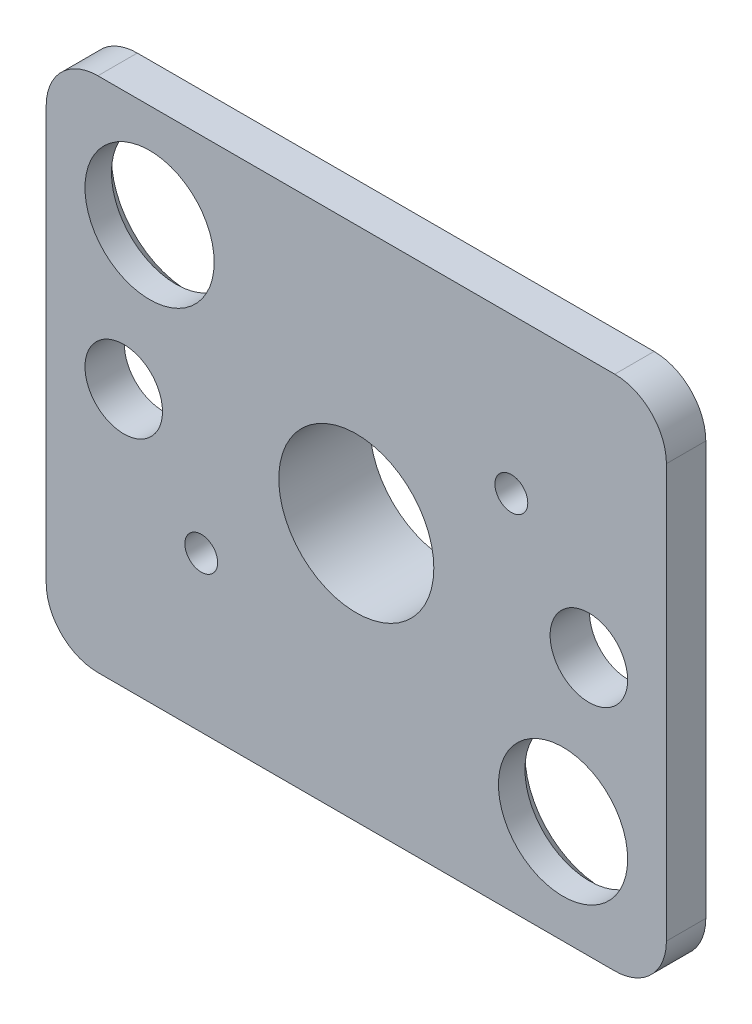
ISO-10303-21;
HEADER;
FILE_DESCRIPTION(('STEP AP214'),'2;1');
FILE_NAME('part.step','',(''),(''),'','','');
FILE_SCHEMA(('AUTOMOTIVE_DESIGN { 1 0 10303 214 1 1 1 1 }'));
ENDSEC;
DATA;
#1=APPLICATION_CONTEXT('core data for automotive mechanical design processes');
#2=APPLICATION_PROTOCOL_DEFINITION('international standard','automotive_design',2000,#1);
#3=PRODUCT_CONTEXT('',#1,'mechanical');
#4=PRODUCT('Part','Part','',(#3));
#5=PRODUCT_RELATED_PRODUCT_CATEGORY('part','',(#4));
#6=PRODUCT_DEFINITION_FORMATION('','',#4);
#7=PRODUCT_DEFINITION_CONTEXT('part definition',#1,'design');
#8=PRODUCT_DEFINITION('design','',#6,#7);
#9=PRODUCT_DEFINITION_SHAPE('','',#8);
#10=(LENGTH_UNIT() NAMED_UNIT(*) SI_UNIT(.MILLI.,.METRE.));
#11=(NAMED_UNIT(*) PLANE_ANGLE_UNIT() SI_UNIT($,.RADIAN.));
#12=(NAMED_UNIT(*) SI_UNIT($,.STERADIAN.) SOLID_ANGLE_UNIT());
#13=UNCERTAINTY_MEASURE_WITH_UNIT(LENGTH_MEASURE(1.E-05),#10,'distance_accuracy_value','');
#14=(GEOMETRIC_REPRESENTATION_CONTEXT(3) GLOBAL_UNCERTAINTY_ASSIGNED_CONTEXT((#13)) GLOBAL_UNIT_ASSIGNED_CONTEXT((#10,
#11,#12)) REPRESENTATION_CONTEXT('',''));
#15=CARTESIAN_POINT('',(0.,0.,0.));
#16=DIRECTION('',(0.,0.,1.));
#17=DIRECTION('',(1.,0.,0.));
#18=AXIS2_PLACEMENT_3D('',#15,#16,#17);
#19=CARTESIAN_POINT('',(6.,-5.,-1.));
#20=DIRECTION('',(0.,0.,1.));
#21=DIRECTION('',(1.,0.,0.));
#22=AXIS2_PLACEMENT_3D('',#19,#20,#21);
#23=CYLINDRICAL_SURFACE('',#22,1.5);
#24=CARTESIAN_POINT('',(6.,-5.,0.762));
#25=DIRECTION('',(0.,0.,1.));
#26=DIRECTION('',(1.,0.,0.));
#27=AXIS2_PLACEMENT_3D('',#24,#25,#26);
#28=CIRCLE('',#27,1.5);
#29=CARTESIAN_POINT('',(7.5,-5.,0.762));
#30=VERTEX_POINT('',#29);
#31=EDGE_CURVE('E91',#30,#30,#28,.F.);
#32=ORIENTED_EDGE('',*,*,#31,.F.);
#33=EDGE_LOOP('',(#32));
#34=FACE_BOUND('',#33,.T.);
#35=CARTESIAN_POINT('',(6.,-5.,-1.));
#36=DIRECTION('',(0.,0.,1.));
#37=DIRECTION('',(1.,0.,0.));
#38=AXIS2_PLACEMENT_3D('',#35,#36,#37);
#39=CIRCLE('',#38,1.5);
#40=CARTESIAN_POINT('',(7.5,-5.,-1.));
#41=VERTEX_POINT('',#40);
#42=EDGE_CURVE('E21',#41,#41,#39,.T.);
#43=ORIENTED_EDGE('',*,*,#42,.F.);
#44=EDGE_LOOP('',(#43));
#45=FACE_BOUND('',#44,.T.);
#46=ADVANCED_FACE('F17',(#34,#45),#23,.F.);
#47=CARTESIAN_POINT('',(2.,-2.,0.25));
#48=DIRECTION('',(0.,0.,1.));
#49=DIRECTION('',(1.,0.,0.));
#50=AXIS2_PLACEMENT_3D('',#47,#48,#49);
#51=CYLINDRICAL_SURFACE('',#50,1.25);
#52=CARTESIAN_POINT('',(2.,-2.,0.762));
#53=DIRECTION('',(0.,0.,1.));
#54=DIRECTION('',(1.,0.,0.));
#55=AXIS2_PLACEMENT_3D('',#52,#53,#54);
#56=CIRCLE('',#55,1.25);
#57=CARTESIAN_POINT('',(3.25,-2.,0.762));
#58=VERTEX_POINT('',#57);
#59=EDGE_CURVE('E174',#58,#58,#56,.F.);
#60=ORIENTED_EDGE('',*,*,#59,.F.);
#61=EDGE_LOOP('',(#60));
#62=FACE_BOUND('',#61,.T.);
#63=CARTESIAN_POINT('',(2.,-2.,0.249999999999972));
#64=DIRECTION('',(0.,0.,-1.));
#65=DIRECTION('',(-1.,0.,0.));
#66=AXIS2_PLACEMENT_3D('',#63,#64,#65);
#67=CIRCLE('',#66,1.25);
#68=CARTESIAN_POINT('',(0.75,-2.,0.25));
#69=VERTEX_POINT('',#68);
#70=EDGE_CURVE('E100',#69,#69,#67,.F.);
#71=ORIENTED_EDGE('',*,*,#70,.F.);
#72=EDGE_LOOP('',(#71));
#73=FACE_BOUND('',#72,.T.);
#74=ADVANCED_FACE('F185',(#62,#73),#51,.F.);
#75=CARTESIAN_POINT('',(8.024,-7.024,-1.));
#76=DIRECTION('',(0.,0.,-1.));
#77=DIRECTION('',(-1.,0.,0.));
#78=AXIS2_PLACEMENT_3D('',#75,#76,#77);
#79=PLANE('',#78);
#80=ORIENTED_EDGE('',*,*,#42,.T.);
#81=EDGE_LOOP('',(#80));
#82=FACE_BOUND('',#81,.T.);
#83=CARTESIAN_POINT('',(6.,-5.,-1.));
#84=DIRECTION('',(0.,0.,1.));
#85=DIRECTION('',(1.,0.,0.));
#86=AXIS2_PLACEMENT_3D('',#83,#84,#85);
#87=CIRCLE('',#86,2.);
#88=CARTESIAN_POINT('',(8.,-5.,-1.));
#89=VERTEX_POINT('',#88);
#90=EDGE_CURVE('E154',#89,#89,#87,.F.);
#91=ORIENTED_EDGE('',*,*,#90,.T.);
#92=EDGE_LOOP('',(#91));
#93=FACE_BOUND('',#92,.T.);
#94=ADVANCED_FACE('F181',(#82,#93),#79,.T.);
#95=CARTESIAN_POINT('',(0.,-10.,0.762));
#96=DIRECTION('',(0.,0.,1.));
#97=DIRECTION('',(1.,0.,0.));
#98=AXIS2_PLACEMENT_3D('',#95,#96,#97);
#99=PLANE('',#98);
#100=ORIENTED_EDGE('',*,*,#31,.T.);
#101=EDGE_LOOP('',(#100));
#102=FACE_BOUND('',#101,.T.);
#103=CARTESIAN_POINT('',(3.,-7.,0.762));
#104=DIRECTION('',(0.,0.,1.));
#105=DIRECTION('',(1.,0.,0.));
#106=AXIS2_PLACEMENT_3D('',#103,#104,#105);
#107=CIRCLE('',#106,0.3175);
#108=CARTESIAN_POINT('',(3.3175,-7.,0.762));
#109=VERTEX_POINT('',#108);
#110=EDGE_CURVE('E103',#109,#109,#107,.T.);
#111=ORIENTED_EDGE('',*,*,#110,.F.);
#112=EDGE_LOOP('',(#111));
#113=FACE_BOUND('',#112,.T.);
#114=ORIENTED_EDGE('',*,*,#59,.T.);
#115=EDGE_LOOP('',(#114));
#116=FACE_BOUND('',#115,.T.);
#117=CARTESIAN_POINT('',(10.,-8.,0.762));
#118=DIRECTION('',(0.,0.,1.));
#119=DIRECTION('',(1.,0.,0.));
#120=AXIS2_PLACEMENT_3D('',#117,#118,#119);
#121=CIRCLE('',#120,1.25);
#122=CARTESIAN_POINT('',(11.25,-8.,0.762));
#123=VERTEX_POINT('',#122);
#124=EDGE_CURVE('E151',#123,#123,#121,.T.);
#125=ORIENTED_EDGE('',*,*,#124,.F.);
#126=EDGE_LOOP('',(#125));
#127=FACE_BOUND('',#126,.T.);
#128=CARTESIAN_POINT('',(10.5,-5.,0.762));
#129=DIRECTION('',(0.,0.,1.));
#130=DIRECTION('',(1.,0.,0.));
#131=AXIS2_PLACEMENT_3D('',#128,#129,#130);
#132=CIRCLE('',#131,0.749999999999999);
#133=CARTESIAN_POINT('',(11.25,-5.,0.762));
#134=VERTEX_POINT('',#133);
#135=EDGE_CURVE('E163',#134,#134,#132,.T.);
#136=ORIENTED_EDGE('',*,*,#135,.F.);
#137=EDGE_LOOP('',(#136));
#138=FACE_BOUND('',#137,.T.);
#139=CARTESIAN_POINT('',(9.,-3.,0.762));
#140=DIRECTION('',(0.,0.,1.));
#141=DIRECTION('',(1.,0.,0.));
#142=AXIS2_PLACEMENT_3D('',#139,#140,#141);
#143=CIRCLE('',#142,0.3175);
#144=CARTESIAN_POINT('',(9.3175,-3.,0.762));
#145=VERTEX_POINT('',#144);
#146=EDGE_CURVE('E160',#145,#145,#143,.T.);
#147=ORIENTED_EDGE('',*,*,#146,.F.);
#148=EDGE_LOOP('',(#147));
#149=FACE_BOUND('',#148,.T.);
#150=CARTESIAN_POINT('',(1.5,-5.,0.762));
#151=DIRECTION('',(0.,0.,1.));
#152=DIRECTION('',(1.,0.,0.));
#153=AXIS2_PLACEMENT_3D('',#150,#151,#152);
#154=CIRCLE('',#153,0.75);
#155=CARTESIAN_POINT('',(2.25,-5.,0.762));
#156=VERTEX_POINT('',#155);
#157=EDGE_CURVE('E157',#156,#156,#154,.T.);
#158=ORIENTED_EDGE('',*,*,#157,.F.);
#159=EDGE_LOOP('',(#158));
#160=FACE_BOUND('',#159,.T.);
#161=DIRECTION('',(-1.,0.,0.));
#162=VECTOR('',#161,1.);
#163=CARTESIAN_POINT('',(6.,0.,0.762));
#164=LINE('',#163,#162);
#165=CARTESIAN_POINT('',(11.,0.,0.762));
#166=VERTEX_POINT('',#165);
#167=CARTESIAN_POINT('',(1.00000000010255,0.,0.762));
#168=VERTEX_POINT('',#167);
#169=EDGE_CURVE('E112',#166,#168,#164,.T.);
#170=ORIENTED_EDGE('',*,*,#169,.T.);
#171=CARTESIAN_POINT('',(1.,-1.,0.762));
#172=DIRECTION('',(0.,0.,-1.));
#173=DIRECTION('',(0.,1.,0.));
#174=AXIS2_PLACEMENT_3D('',#171,#172,#173);
#175=CIRCLE('',#174,1.);
#176=CARTESIAN_POINT('',(0.,-1.,0.762));
#177=VERTEX_POINT('',#176);
#178=EDGE_CURVE('E169',#168,#177,#175,.F.);
#179=ORIENTED_EDGE('',*,*,#178,.T.);
#180=DIRECTION('',(0.,-1.,0.));
#181=VECTOR('',#180,1.);
#182=CARTESIAN_POINT('',(0.,-5.,0.762));
#183=LINE('',#182,#181);
#184=CARTESIAN_POINT('',(0.,-9.00000000008979,0.762));
#185=VERTEX_POINT('',#184);
#186=EDGE_CURVE('E108',#177,#185,#183,.T.);
#187=ORIENTED_EDGE('',*,*,#186,.T.);
#188=CARTESIAN_POINT('',(1.,-9.,0.762));
#189=DIRECTION('',(0.,0.,-1.));
#190=DIRECTION('',(0.,1.,0.));
#191=AXIS2_PLACEMENT_3D('',#188,#189,#190);
#192=CIRCLE('',#191,1.);
#193=CARTESIAN_POINT('',(1.,-10.,0.762));
#194=VERTEX_POINT('',#193);
#195=EDGE_CURVE('E96',#185,#194,#192,.F.);
#196=ORIENTED_EDGE('',*,*,#195,.T.);
#197=DIRECTION('',(1.,0.,0.));
#198=VECTOR('',#197,1.);
#199=CARTESIAN_POINT('',(6.,-10.,0.762));
#200=LINE('',#199,#198);
#201=CARTESIAN_POINT('',(11.,-10.,0.762));
#202=VERTEX_POINT('',#201);
#203=EDGE_CURVE('E94',#194,#202,#200,.T.);
#204=ORIENTED_EDGE('',*,*,#203,.T.);
#205=CARTESIAN_POINT('',(11.,-9.,0.762));
#206=DIRECTION('',(0.,0.,-1.));
#207=DIRECTION('',(0.,1.,0.));
#208=AXIS2_PLACEMENT_3D('',#205,#206,#207);
#209=CIRCLE('',#208,0.999999999999999);
#210=CARTESIAN_POINT('',(12.,-9.,0.762));
#211=VERTEX_POINT('',#210);
#212=EDGE_CURVE('E82',#202,#211,#209,.F.);
#213=ORIENTED_EDGE('',*,*,#212,.T.);
#214=DIRECTION('',(0.,1.,0.));
#215=VECTOR('',#214,1.);
#216=CARTESIAN_POINT('',(12.,-5.,0.762));
#217=LINE('',#216,#215);
#218=CARTESIAN_POINT('',(12.,-1.0000000002051,0.762));
#219=VERTEX_POINT('',#218);
#220=EDGE_CURVE('E116',#211,#219,#217,.T.);
#221=ORIENTED_EDGE('',*,*,#220,.T.);
#222=CARTESIAN_POINT('',(11.,-1.,0.762));
#223=DIRECTION('',(0.,0.,-1.));
#224=DIRECTION('',(0.,1.,0.));
#225=AXIS2_PLACEMENT_3D('',#222,#223,#224);
#226=CIRCLE('',#225,0.999999999999999);
#227=EDGE_CURVE('E171',#219,#166,#226,.F.);
#228=ORIENTED_EDGE('',*,*,#227,.T.);
#229=EDGE_LOOP('',(#170,#179,#187,#196,#204,#213,#221,#228));
#230=FACE_BOUND('',#229,.T.);
#231=ADVANCED_FACE('F98',(#102,#113,#116,#127,#138,#149,#160,#230),#99,.T.);
#232=CARTESIAN_POINT('',(11.,-9.,0.762));
#233=DIRECTION('',(0.,0.,-1.));
#234=DIRECTION('',(0.,1.,0.));
#235=AXIS2_PLACEMENT_3D('',#232,#233,#234);
#236=CYLINDRICAL_SURFACE('',#235,0.999999999999999);
#237=DIRECTION('',(0.,0.,-1.));
#238=VECTOR('',#237,1.);
#239=CARTESIAN_POINT('',(11.,-10.,0.381));
#240=LINE('',#239,#238);
#241=CARTESIAN_POINT('',(11.,-10.,0.));
#242=VERTEX_POINT('',#241);
#243=EDGE_CURVE('E86',#202,#242,#240,.T.);
#244=ORIENTED_EDGE('',*,*,#243,.T.);
#245=CARTESIAN_POINT('',(11.,-9.,0.));
#246=DIRECTION('',(0.,0.,-1.));
#247=DIRECTION('',(0.,1.,0.));
#248=AXIS2_PLACEMENT_3D('',#245,#246,#247);
#249=CIRCLE('',#248,0.999999999999999);
#250=CARTESIAN_POINT('',(12.,-9.,0.));
#251=VERTEX_POINT('',#250);
#252=EDGE_CURVE('E149',#242,#251,#249,.F.);
#253=ORIENTED_EDGE('',*,*,#252,.T.);
#254=DIRECTION('',(0.,0.,1.));
#255=VECTOR('',#254,1.);
#256=CARTESIAN_POINT('',(12.,-9.,0.381));
#257=LINE('',#256,#255);
#258=EDGE_CURVE('E87',#251,#211,#257,.T.);
#259=ORIENTED_EDGE('',*,*,#258,.T.);
#260=ORIENTED_EDGE('',*,*,#212,.F.);
#261=EDGE_LOOP('',(#244,#253,#259,#260));
#262=FACE_BOUND('',#261,.T.);
#263=ADVANCED_FACE('F84',(#262),#236,.T.);
#264=CARTESIAN_POINT('',(12.,-9.,0.));
#265=DIRECTION('',(-1.,0.,0.));
#266=DIRECTION('',(0.,0.,1.));
#267=AXIS2_PLACEMENT_3D('',#264,#265,#266);
#268=PLANE('',#267);
#269=ORIENTED_EDGE('',*,*,#258,.F.);
#270=DIRECTION('',(0.,1.,0.));
#271=VECTOR('',#270,1.);
#272=CARTESIAN_POINT('',(12.,-5.,0.));
#273=LINE('',#272,#271);
#274=CARTESIAN_POINT('',(12.,-1.0000000002051,0.));
#275=VERTEX_POINT('',#274);
#276=EDGE_CURVE('E148',#251,#275,#273,.T.);
#277=ORIENTED_EDGE('',*,*,#276,.T.);
#278=DIRECTION('',(0.,0.,-1.));
#279=VECTOR('',#278,1.);
#280=CARTESIAN_POINT('',(12.,-1.00000000041021,0.381));
#281=LINE('',#280,#279);
#282=EDGE_CURVE('E117',#275,#219,#281,.F.);
#283=ORIENTED_EDGE('',*,*,#282,.T.);
#284=ORIENTED_EDGE('',*,*,#220,.F.);
#285=EDGE_LOOP('',(#269,#277,#283,#284));
#286=FACE_BOUND('',#285,.T.);
#287=ADVANCED_FACE('F248',(#286),#268,.F.);
#288=CARTESIAN_POINT('',(11.,-1.,0.762));
#289=DIRECTION('',(0.,0.,-1.));
#290=DIRECTION('',(0.,1.,0.));
#291=AXIS2_PLACEMENT_3D('',#288,#289,#290);
#292=CYLINDRICAL_SURFACE('',#291,0.999999999999999);
#293=ORIENTED_EDGE('',*,*,#282,.F.);
#294=CARTESIAN_POINT('',(11.,-1.,0.));
#295=DIRECTION('',(0.,0.,-1.));
#296=DIRECTION('',(0.,1.,0.));
#297=AXIS2_PLACEMENT_3D('',#294,#295,#296);
#298=CIRCLE('',#297,0.999999999999999);
#299=CARTESIAN_POINT('',(11.,0.,0.));
#300=VERTEX_POINT('',#299);
#301=EDGE_CURVE('E145',#275,#300,#298,.F.);
#302=ORIENTED_EDGE('',*,*,#301,.T.);
#303=DIRECTION('',(0.,0.,1.));
#304=VECTOR('',#303,1.);
#305=CARTESIAN_POINT('',(11.,0.,0.381));
#306=LINE('',#305,#304);
#307=EDGE_CURVE('E115',#300,#166,#306,.T.);
#308=ORIENTED_EDGE('',*,*,#307,.T.);
#309=ORIENTED_EDGE('',*,*,#227,.F.);
#310=EDGE_LOOP('',(#293,#302,#308,#309));
#311=FACE_BOUND('',#310,.T.);
#312=ADVANCED_FACE('F245',(#311),#292,.T.);
#313=CARTESIAN_POINT('',(1.,0.,0.762));
#314=DIRECTION('',(0.,-1.,0.));
#315=DIRECTION('',(0.,0.,-1.));
#316=AXIS2_PLACEMENT_3D('',#313,#314,#315);
#317=PLANE('',#316);
#318=ORIENTED_EDGE('',*,*,#307,.F.);
#319=DIRECTION('',(-1.,0.,0.));
#320=VECTOR('',#319,1.);
#321=CARTESIAN_POINT('',(6.,0.,0.));
#322=LINE('',#321,#320);
#323=CARTESIAN_POINT('',(1.00000000010255,0.,0.));
#324=VERTEX_POINT('',#323);
#325=EDGE_CURVE('E144',#300,#324,#322,.T.);
#326=ORIENTED_EDGE('',*,*,#325,.T.);
#327=DIRECTION('',(0.,0.,-1.));
#328=VECTOR('',#327,1.);
#329=CARTESIAN_POINT('',(1.0000000002051,0.,0.381));
#330=LINE('',#329,#328);
#331=EDGE_CURVE('E114',#324,#168,#330,.F.);
#332=ORIENTED_EDGE('',*,*,#331,.T.);
#333=ORIENTED_EDGE('',*,*,#169,.F.);
#334=EDGE_LOOP('',(#318,#326,#332,#333));
#335=FACE_BOUND('',#334,.T.);
#336=ADVANCED_FACE('F243',(#335),#317,.F.);
#337=CARTESIAN_POINT('',(1.,-1.,0.762));
#338=DIRECTION('',(0.,0.,-1.));
#339=DIRECTION('',(0.,1.,0.));
#340=AXIS2_PLACEMENT_3D('',#337,#338,#339);
#341=CYLINDRICAL_SURFACE('',#340,1.);
#342=ORIENTED_EDGE('',*,*,#331,.F.);
#343=CARTESIAN_POINT('',(1.,-1.,0.));
#344=DIRECTION('',(0.,0.,-1.));
#345=DIRECTION('',(0.,1.,0.));
#346=AXIS2_PLACEMENT_3D('',#343,#344,#345);
#347=CIRCLE('',#346,1.);
#348=CARTESIAN_POINT('',(0.,-1.,0.));
#349=VERTEX_POINT('',#348);
#350=EDGE_CURVE('E141',#324,#349,#347,.F.);
#351=ORIENTED_EDGE('',*,*,#350,.T.);
#352=DIRECTION('',(0.,0.,1.));
#353=VECTOR('',#352,1.);
#354=CARTESIAN_POINT('',(0.,-1.,0.381));
#355=LINE('',#354,#353);
#356=EDGE_CURVE('E111',#349,#177,#355,.T.);
#357=ORIENTED_EDGE('',*,*,#356,.T.);
#358=ORIENTED_EDGE('',*,*,#178,.F.);
#359=EDGE_LOOP('',(#342,#351,#357,#358));
#360=FACE_BOUND('',#359,.T.);
#361=ADVANCED_FACE('F240',(#360),#341,.T.);
#362=CARTESIAN_POINT('',(0.,-9.,0.));
#363=DIRECTION('',(1.,0.,0.));
#364=DIRECTION('',(0.,1.,0.));
#365=AXIS2_PLACEMENT_3D('',#362,#363,#364);
#366=PLANE('',#365);
#367=DIRECTION('',(0.,0.,-1.));
#368=VECTOR('',#367,1.);
#369=CARTESIAN_POINT('',(0.,-9.00000000017959,0.381));
#370=LINE('',#369,#368);
#371=CARTESIAN_POINT('',(0.,-9.00000000008979,0.));
#372=VERTEX_POINT('',#371);
#373=EDGE_CURVE('E110',#372,#185,#370,.F.);
#374=ORIENTED_EDGE('',*,*,#373,.T.);
#375=ORIENTED_EDGE('',*,*,#186,.F.);
#376=ORIENTED_EDGE('',*,*,#356,.F.);
#377=DIRECTION('',(0.,-1.,0.));
#378=VECTOR('',#377,1.);
#379=CARTESIAN_POINT('',(0.,-5.,0.));
#380=LINE('',#379,#378);
#381=EDGE_CURVE('E140',#349,#372,#380,.T.);
#382=ORIENTED_EDGE('',*,*,#381,.T.);
#383=EDGE_LOOP('',(#374,#375,#376,#382));
#384=FACE_BOUND('',#383,.T.);
#385=ADVANCED_FACE('F238',(#384),#366,.F.);
#386=CARTESIAN_POINT('',(1.,-9.,0.762));
#387=DIRECTION('',(0.,0.,-1.));
#388=DIRECTION('',(0.,1.,0.));
#389=AXIS2_PLACEMENT_3D('',#386,#387,#388);
#390=CYLINDRICAL_SURFACE('',#389,1.);
#391=ORIENTED_EDGE('',*,*,#373,.F.);
#392=CARTESIAN_POINT('',(1.,-9.,0.));
#393=DIRECTION('',(0.,0.,-1.));
#394=DIRECTION('',(0.,1.,0.));
#395=AXIS2_PLACEMENT_3D('',#392,#393,#394);
#396=CIRCLE('',#395,1.);
#397=CARTESIAN_POINT('',(1.,-10.,0.));
#398=VERTEX_POINT('',#397);
#399=EDGE_CURVE('E137',#372,#398,#396,.F.);
#400=ORIENTED_EDGE('',*,*,#399,.T.);
#401=DIRECTION('',(0.,0.,1.));
#402=VECTOR('',#401,1.);
#403=CARTESIAN_POINT('',(1.,-10.,0.381));
#404=LINE('',#403,#402);
#405=EDGE_CURVE('E36',#398,#194,#404,.T.);
#406=ORIENTED_EDGE('',*,*,#405,.T.);
#407=ORIENTED_EDGE('',*,*,#195,.F.);
#408=EDGE_LOOP('',(#391,#400,#406,#407));
#409=FACE_BOUND('',#408,.T.);
#410=ADVANCED_FACE('F235',(#409),#390,.T.);
#411=CARTESIAN_POINT('',(11.,-10.,0.));
#412=DIRECTION('',(0.,1.,0.));
#413=DIRECTION('',(-1.,0.,0.));
#414=AXIS2_PLACEMENT_3D('',#411,#412,#413);
#415=PLANE('',#414);
#416=ORIENTED_EDGE('',*,*,#405,.F.);
#417=DIRECTION('',(1.,0.,0.));
#418=VECTOR('',#417,1.);
#419=CARTESIAN_POINT('',(6.,-10.,0.));
#420=LINE('',#419,#418);
#421=EDGE_CURVE('E95',#398,#242,#420,.T.);
#422=ORIENTED_EDGE('',*,*,#421,.T.);
#423=ORIENTED_EDGE('',*,*,#243,.F.);
#424=ORIENTED_EDGE('',*,*,#203,.F.);
#425=EDGE_LOOP('',(#416,#422,#423,#424));
#426=FACE_BOUND('',#425,.T.);
#427=ADVANCED_FACE('F93',(#426),#415,.F.);
#428=CARTESIAN_POINT('',(2.,-2.,0.25));
#429=DIRECTION('',(0.,0.,-1.));
#430=DIRECTION('',(-1.,0.,0.));
#431=AXIS2_PLACEMENT_3D('',#428,#429,#430);
#432=CONICAL_SURFACE('',#431,1.25,0.785398163397449);
#433=CARTESIAN_POINT('',(2.,-2.,0.));
#434=DIRECTION('',(0.,0.,-1.));
#435=DIRECTION('',(-1.,0.,0.));
#436=AXIS2_PLACEMENT_3D('',#433,#434,#435);
#437=CIRCLE('',#436,1.5);
#438=CARTESIAN_POINT('',(0.5,-2.,0.));
#439=VERTEX_POINT('',#438);
#440=EDGE_CURVE('E134',#439,#439,#437,.T.);
#441=ORIENTED_EDGE('',*,*,#440,.T.);
#442=EDGE_LOOP('',(#441));
#443=FACE_BOUND('',#442,.T.);
#444=ORIENTED_EDGE('',*,*,#70,.T.);
#445=EDGE_LOOP('',(#444));
#446=FACE_BOUND('',#445,.T.);
#447=ADVANCED_FACE('F230',(#443,#446),#432,.F.);
#448=CARTESIAN_POINT('',(3.,-7.,0.));
#449=DIRECTION('',(0.,0.,1.));
#450=DIRECTION('',(1.,0.,0.));
#451=AXIS2_PLACEMENT_3D('',#448,#449,#450);
#452=CYLINDRICAL_SURFACE('',#451,0.3175);
#453=CARTESIAN_POINT('',(3.,-7.,0.));
#454=DIRECTION('',(0.,0.,1.));
#455=DIRECTION('',(1.,0.,0.));
#456=AXIS2_PLACEMENT_3D('',#453,#454,#455);
#457=CIRCLE('',#456,0.3175);
#458=CARTESIAN_POINT('',(3.3175,-7.,0.));
#459=VERTEX_POINT('',#458);
#460=EDGE_CURVE('E131',#459,#459,#457,.F.);
#461=ORIENTED_EDGE('',*,*,#460,.T.);
#462=EDGE_LOOP('',(#461));
#463=FACE_BOUND('',#462,.T.);
#464=ORIENTED_EDGE('',*,*,#110,.T.);
#465=EDGE_LOOP('',(#464));
#466=FACE_BOUND('',#465,.T.);
#467=ADVANCED_FACE('F226',(#463,#466),#452,.F.);
#468=CARTESIAN_POINT('',(10.5,-5.,0.));
#469=DIRECTION('',(0.,0.,1.));
#470=DIRECTION('',(1.,0.,0.));
#471=AXIS2_PLACEMENT_3D('',#468,#469,#470);
#472=CYLINDRICAL_SURFACE('',#471,0.749999999999999);
#473=CARTESIAN_POINT('',(10.5,-5.,0.));
#474=DIRECTION('',(0.,0.,1.));
#475=DIRECTION('',(1.,0.,0.));
#476=AXIS2_PLACEMENT_3D('',#473,#474,#475);
#477=CIRCLE('',#476,0.749999999999999);
#478=CARTESIAN_POINT('',(11.25,-5.,0.));
#479=VERTEX_POINT('',#478);
#480=EDGE_CURVE('E128',#479,#479,#477,.F.);
#481=ORIENTED_EDGE('',*,*,#480,.T.);
#482=EDGE_LOOP('',(#481));
#483=FACE_BOUND('',#482,.T.);
#484=ORIENTED_EDGE('',*,*,#135,.T.);
#485=EDGE_LOOP('',(#484));
#486=FACE_BOUND('',#485,.T.);
#487=ADVANCED_FACE('F222',(#483,#486),#472,.F.);
#488=CARTESIAN_POINT('',(9.,-3.,0.));
#489=DIRECTION('',(0.,0.,1.));
#490=DIRECTION('',(1.,0.,0.));
#491=AXIS2_PLACEMENT_3D('',#488,#489,#490);
#492=CYLINDRICAL_SURFACE('',#491,0.3175);
#493=CARTESIAN_POINT('',(9.,-3.,0.));
#494=DIRECTION('',(0.,0.,1.));
#495=DIRECTION('',(1.,0.,0.));
#496=AXIS2_PLACEMENT_3D('',#493,#494,#495);
#497=CIRCLE('',#496,0.3175);
#498=CARTESIAN_POINT('',(9.3175,-3.,0.));
#499=VERTEX_POINT('',#498);
#500=EDGE_CURVE('E125',#499,#499,#497,.F.);
#501=ORIENTED_EDGE('',*,*,#500,.T.);
#502=EDGE_LOOP('',(#501));
#503=FACE_BOUND('',#502,.T.);
#504=ORIENTED_EDGE('',*,*,#146,.T.);
#505=EDGE_LOOP('',(#504));
#506=FACE_BOUND('',#505,.T.);
#507=ADVANCED_FACE('F218',(#503,#506),#492,.F.);
#508=CARTESIAN_POINT('',(1.5,-5.,0.));
#509=DIRECTION('',(0.,0.,1.));
#510=DIRECTION('',(1.,0.,0.));
#511=AXIS2_PLACEMENT_3D('',#508,#509,#510);
#512=CYLINDRICAL_SURFACE('',#511,0.75);
#513=CARTESIAN_POINT('',(1.5,-5.,0.));
#514=DIRECTION('',(0.,0.,1.));
#515=DIRECTION('',(1.,0.,0.));
#516=AXIS2_PLACEMENT_3D('',#513,#514,#515);
#517=CIRCLE('',#516,0.75);
#518=CARTESIAN_POINT('',(2.25,-5.,0.));
#519=VERTEX_POINT('',#518);
#520=EDGE_CURVE('E122',#519,#519,#517,.F.);
#521=ORIENTED_EDGE('',*,*,#520,.T.);
#522=EDGE_LOOP('',(#521));
#523=FACE_BOUND('',#522,.T.);
#524=ORIENTED_EDGE('',*,*,#157,.T.);
#525=EDGE_LOOP('',(#524));
#526=FACE_BOUND('',#525,.T.);
#527=ADVANCED_FACE('F214',(#523,#526),#512,.F.);
#528=CARTESIAN_POINT('',(6.,-5.,-1.));
#529=DIRECTION('',(0.,0.,1.));
#530=DIRECTION('',(1.,0.,0.));
#531=AXIS2_PLACEMENT_3D('',#528,#529,#530);
#532=CYLINDRICAL_SURFACE('',#531,2.);
#533=ORIENTED_EDGE('',*,*,#90,.F.);
#534=EDGE_LOOP('',(#533));
#535=FACE_BOUND('',#534,.T.);
#536=CARTESIAN_POINT('',(6.,-5.,0.));
#537=DIRECTION('',(0.,0.,1.));
#538=DIRECTION('',(1.,0.,0.));
#539=AXIS2_PLACEMENT_3D('',#536,#537,#538);
#540=CIRCLE('',#539,2.);
#541=CARTESIAN_POINT('',(8.,-5.,0.));
#542=VERTEX_POINT('',#541);
#543=EDGE_CURVE('E119',#542,#542,#540,.F.);
#544=ORIENTED_EDGE('',*,*,#543,.T.);
#545=EDGE_LOOP('',(#544));
#546=FACE_BOUND('',#545,.T.);
#547=ADVANCED_FACE('F210',(#535,#546),#532,.T.);
#548=CARTESIAN_POINT('',(10.,-8.,0.25));
#549=DIRECTION('',(0.,0.,1.));
#550=DIRECTION('',(1.,0.,0.));
#551=AXIS2_PLACEMENT_3D('',#548,#549,#550);
#552=CYLINDRICAL_SURFACE('',#551,1.25);
#553=CARTESIAN_POINT('',(10.,-8.,0.249999999999972));
#554=DIRECTION('',(0.,0.,-1.));
#555=DIRECTION('',(-1.,0.,0.));
#556=AXIS2_PLACEMENT_3D('',#553,#554,#555);
#557=CIRCLE('',#556,1.25);
#558=CARTESIAN_POINT('',(8.75,-8.,0.25));
#559=VERTEX_POINT('',#558);
#560=EDGE_CURVE('E27',#559,#559,#557,.F.);
#561=ORIENTED_EDGE('',*,*,#560,.F.);
#562=EDGE_LOOP('',(#561));
#563=FACE_BOUND('',#562,.T.);
#564=ORIENTED_EDGE('',*,*,#124,.T.);
#565=EDGE_LOOP('',(#564));
#566=FACE_BOUND('',#565,.T.);
#567=ADVANCED_FACE('F203',(#563,#566),#552,.F.);
#568=CARTESIAN_POINT('',(0.,-10.,0.));
#569=DIRECTION('',(0.,0.,1.));
#570=DIRECTION('',(1.,0.,0.));
#571=AXIS2_PLACEMENT_3D('',#568,#569,#570);
#572=PLANE('',#571);
#573=ORIENTED_EDGE('',*,*,#543,.F.);
#574=EDGE_LOOP('',(#573));
#575=FACE_BOUND('',#574,.T.);
#576=ORIENTED_EDGE('',*,*,#520,.F.);
#577=EDGE_LOOP('',(#576));
#578=FACE_BOUND('',#577,.T.);
#579=ORIENTED_EDGE('',*,*,#500,.F.);
#580=EDGE_LOOP('',(#579));
#581=FACE_BOUND('',#580,.T.);
#582=ORIENTED_EDGE('',*,*,#480,.F.);
#583=EDGE_LOOP('',(#582));
#584=FACE_BOUND('',#583,.T.);
#585=ORIENTED_EDGE('',*,*,#460,.F.);
#586=EDGE_LOOP('',(#585));
#587=FACE_BOUND('',#586,.T.);
#588=CARTESIAN_POINT('',(10.,-8.,0.));
#589=DIRECTION('',(0.,0.,-1.));
#590=DIRECTION('',(-1.,0.,0.));
#591=AXIS2_PLACEMENT_3D('',#588,#589,#590);
#592=CIRCLE('',#591,1.5);
#593=CARTESIAN_POINT('',(8.5,-8.,0.));
#594=VERTEX_POINT('',#593);
#595=EDGE_CURVE('E11',#594,#594,#592,.T.);
#596=ORIENTED_EDGE('',*,*,#595,.F.);
#597=EDGE_LOOP('',(#596));
#598=FACE_BOUND('',#597,.T.);
#599=ORIENTED_EDGE('',*,*,#440,.F.);
#600=EDGE_LOOP('',(#599));
#601=FACE_BOUND('',#600,.T.);
#602=ORIENTED_EDGE('',*,*,#399,.F.);
#603=ORIENTED_EDGE('',*,*,#381,.F.);
#604=ORIENTED_EDGE('',*,*,#350,.F.);
#605=ORIENTED_EDGE('',*,*,#325,.F.);
#606=ORIENTED_EDGE('',*,*,#301,.F.);
#607=ORIENTED_EDGE('',*,*,#276,.F.);
#608=ORIENTED_EDGE('',*,*,#252,.F.);
#609=ORIENTED_EDGE('',*,*,#421,.F.);
#610=EDGE_LOOP('',(#602,#603,#604,#605,#606,#607,#608,#609));
#611=FACE_BOUND('',#610,.T.);
#612=ADVANCED_FACE('F19',(#575,#578,#581,#584,#587,#598,#601,#611),#572,.F.);
#613=CARTESIAN_POINT('',(10.,-8.,0.25));
#614=DIRECTION('',(0.,0.,-1.));
#615=DIRECTION('',(-1.,0.,0.));
#616=AXIS2_PLACEMENT_3D('',#613,#614,#615);
#617=CONICAL_SURFACE('',#616,1.25,0.785398163397449);
#618=ORIENTED_EDGE('',*,*,#560,.T.);
#619=EDGE_LOOP('',(#618));
#620=FACE_BOUND('',#619,.T.);
#621=ORIENTED_EDGE('',*,*,#595,.T.);
#622=EDGE_LOOP('',(#621));
#623=FACE_BOUND('',#622,.T.);
#624=ADVANCED_FACE('F196',(#620,#623),#617,.F.);
#625=CLOSED_SHELL('',(#46,#74,#94,#231,#263,#287,#312,#336,#361,#385,#410,#427,#447,#467,#487,
#507,#527,#547,#567,#612,#624));
#626=MANIFOLD_SOLID_BREP('B1',#625);
#627=ADVANCED_BREP_SHAPE_REPRESENTATION('',(#18,#626),#14);
#628=SHAPE_DEFINITION_REPRESENTATION(#9,#627);
ENDSEC;
END-ISO-10303-21;
